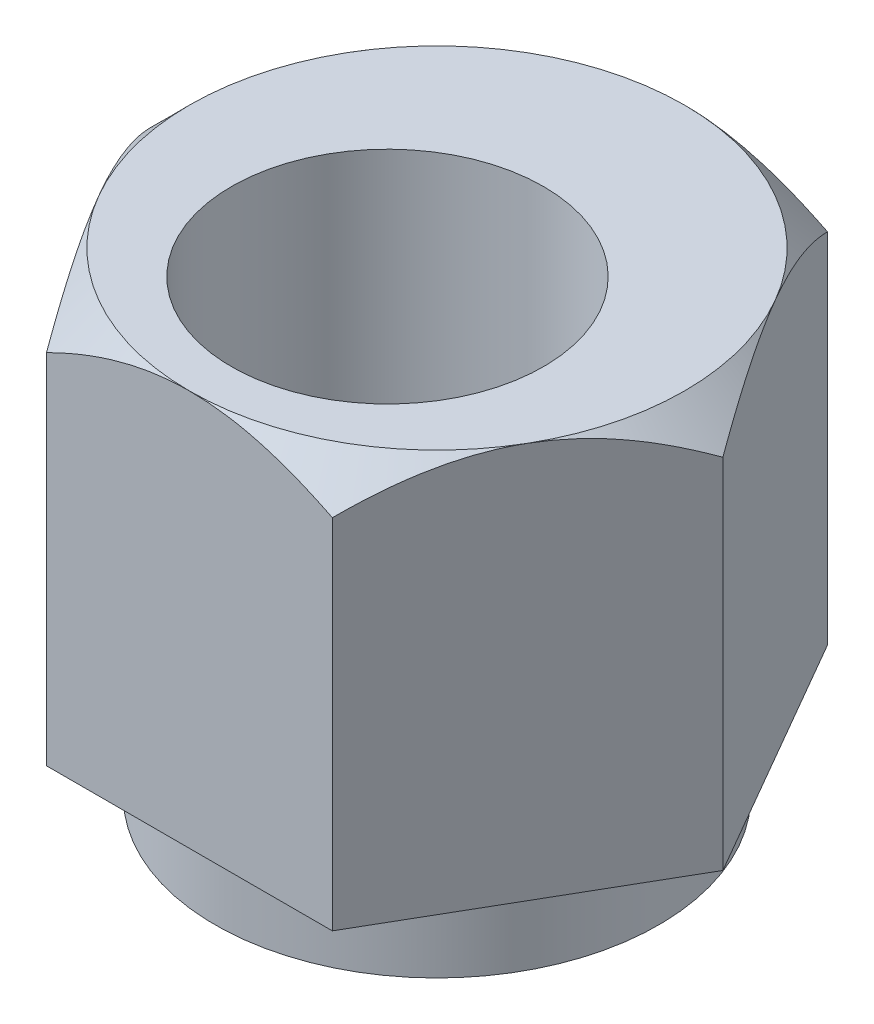
ISO-10303-21;
HEADER;
FILE_DESCRIPTION(('STEP AP214'),'2;1');
FILE_NAME('part.step','',(''),(''),'','','');
FILE_SCHEMA(('AUTOMOTIVE_DESIGN { 1 0 10303 214 1 1 1 1 }'));
ENDSEC;
DATA;
#1=APPLICATION_CONTEXT('core data for automotive mechanical design processes');
#2=APPLICATION_PROTOCOL_DEFINITION('international standard','automotive_design',2000,#1);
#3=PRODUCT_CONTEXT('',#1,'mechanical');
#4=PRODUCT('Part','Part','',(#3));
#5=PRODUCT_RELATED_PRODUCT_CATEGORY('part','',(#4));
#6=PRODUCT_DEFINITION_FORMATION('','',#4);
#7=PRODUCT_DEFINITION_CONTEXT('part definition',#1,'design');
#8=PRODUCT_DEFINITION('design','',#6,#7);
#9=PRODUCT_DEFINITION_SHAPE('','',#8);
#10=(LENGTH_UNIT() NAMED_UNIT(*) SI_UNIT(.MILLI.,.METRE.));
#11=(NAMED_UNIT(*) PLANE_ANGLE_UNIT() SI_UNIT($,.RADIAN.));
#12=(NAMED_UNIT(*) SI_UNIT($,.STERADIAN.) SOLID_ANGLE_UNIT());
#13=UNCERTAINTY_MEASURE_WITH_UNIT(LENGTH_MEASURE(1.E-05),#10,'distance_accuracy_value','');
#14=(GEOMETRIC_REPRESENTATION_CONTEXT(3) GLOBAL_UNCERTAINTY_ASSIGNED_CONTEXT((#13)) GLOBAL_UNIT_ASSIGNED_CONTEXT((#10,
#11,#12)) REPRESENTATION_CONTEXT('',''));
#15=CARTESIAN_POINT('',(0.,0.,0.));
#16=DIRECTION('',(0.,0.,1.));
#17=DIRECTION('',(1.,0.,0.));
#18=AXIS2_PLACEMENT_3D('',#15,#16,#17);
#19=CARTESIAN_POINT('',(-2.2913588808461,0.,3.96875));
#20=DIRECTION('',(0.,0.,1.));
#21=DIRECTION('',(1.,0.,0.));
#22=AXIS2_PLACEMENT_3D('',#19,#20,#21);
#23=PLANE('',#22);
#24=CARTESIAN_POINT('',(0.,6.35000000001037,3.96875));
#25=CARTESIAN_POINT('',(0.0609557316730459,6.35000488133722,3.96875));
#26=CARTESIAN_POINT('',(0.121902350553326,6.34859497366169,3.96875));
#27=CARTESIAN_POINT('',(0.243658193729356,6.34299156350032,3.96875));
#28=CARTESIAN_POINT('',(0.304467438128406,6.33879849888888,3.96875));
#29=CARTESIAN_POINT('',(0.486299334097612,6.32213482831598,3.96875));
#30=CARTESIAN_POINT('',(0.606967881394216,6.30557938195311,3.96875));
#31=CARTESIAN_POINT('',(0.844645959809906,6.26277651278756,3.96875));
#32=CARTESIAN_POINT('',(0.961683228128024,6.23667902816225,3.96875));
#33=CARTESIAN_POINT('',(1.19353706573176,6.17592700561008,3.96875));
#34=CARTESIAN_POINT('',(1.30835292735248,6.14126978771224,3.96875));
#35=CARTESIAN_POINT('',(1.49612748570887,6.07793770471814,3.96875));
#36=CARTESIAN_POINT('',(1.56980436757749,6.05135110793283,3.96875));
#37=CARTESIAN_POINT('',(1.71607903531892,5.99540177755504,3.96875));
#38=CARTESIAN_POINT('',(1.78867704507206,5.96603962950481,3.96875));
#39=CARTESIAN_POINT('',(1.93356616677268,5.90453387116771,3.96875));
#40=CARTESIAN_POINT('',(2.0058463431296,5.87236463934303,3.96875));
#41=CARTESIAN_POINT('',(2.14936914087365,5.80579822195621,3.96875));
#42=CARTESIAN_POINT('',(2.22061183097528,5.77140118477506,3.96875));
#43=CARTESIAN_POINT('',(2.29135881011243,5.73603227368466,3.96875));
#44=B_SPLINE_CURVE_WITH_KNOTS('',3,(#24,#25,#26,#27,#28,#29,#30,#31,#32,#33,#34,#35,#36,#37,#38,
#39,#40,#41,#42,#43),.UNSPECIFIED.,.F.,.F.,(4,2,2,2,2,2,2,2,2,4),(0.,0.182833467204107,
0.365638176014578,0.730525119994046,1.0899089115664,1.44940536573622,1.68433370731859,
1.9192125975474,2.15652018843151,2.39381198987742),.UNSPECIFIED.);
#45=CARTESIAN_POINT('',(0.,6.350000000004,3.96875000000637));
#46=VERTEX_POINT('',#45);
#47=CARTESIAN_POINT('',(2.29135884547952,5.73603225600112,3.96875));
#48=VERTEX_POINT('',#47);
#49=EDGE_CURVE('E212',#46,#48,#44,.T.);
#50=ORIENTED_EDGE('',*,*,#49,.F.);
#51=CARTESIAN_POINT('',(-2.29135889498472,5.73603223124852,3.96875));
#52=CARTESIAN_POINT('',(-2.21206069060932,5.77567522469929,3.96875));
#53=CARTESIAN_POINT('',(-2.13214930134165,5.81409385590243,3.96875));
#54=CARTESIAN_POINT('',(-1.97097660547513,5.8881082508261,3.96875));
#55=CARTESIAN_POINT('',(-1.88971454871652,5.92370237783419,3.96875));
#56=CARTESIAN_POINT('',(-1.64288471432053,6.0260215787352,3.96875));
#57=CARTESIAN_POINT('',(-1.47521050985534,6.08780433701921,3.96875));
#58=CARTESIAN_POINT('',(-1.13930275837644,6.19268916957268,3.96875));
#59=CARTESIAN_POINT('',(-0.971227096592204,6.23628197775752,3.96875));
#60=CARTESIAN_POINT('',(-0.716427954487995,6.28671462111019,3.96875));
#61=CARTESIAN_POINT('',(-0.631153669824669,6.30102430589624,3.96875));
#62=CARTESIAN_POINT('',(-0.459891862641758,6.32434198360343,3.96875));
#63=CARTESIAN_POINT('',(-0.373904568105045,6.33335160958217,3.96875));
#64=CARTESIAN_POINT('',(-0.239948022420144,6.3430391311263,3.96875));
#65=CARTESIAN_POINT('',(-0.192110633518143,6.34564069330178,3.96875));
#66=CARTESIAN_POINT('',(-0.0961836590352683,6.34912553367231,3.96875));
#67=CARTESIAN_POINT('',(-0.0480938250504291,6.35000196490856,3.96875));
#68=CARTESIAN_POINT('',(0.,6.35000000001037,3.96875));
#69=B_SPLINE_CURVE_WITH_KNOTS('',3,(#51,#52,#53,#54,#55,#56,#57,#58,#59,#60,#61,#62,#63,#64,#65,
#66,#67,#68),.UNSPECIFIED.,.F.,.F.,(4,2,2,2,2,2,2,2,4),(0.,0.265949929233719,0.5320528595878,
1.06740851487462,1.58720504023264,1.84646725333807,2.10564954050202,2.24934610610617,
2.39361185535044),.UNSPECIFIED.);
#70=CARTESIAN_POINT('',(-2.2913588985323,5.73603225600605,3.96874996936426));
#71=VERTEX_POINT('',#70);
#72=EDGE_CURVE('E226',#71,#46,#69,.T.);
#73=ORIENTED_EDGE('',*,*,#72,.F.);
#74=DIRECTION('',(0.,1.,0.));
#75=VECTOR('',#74,1.);
#76=CARTESIAN_POINT('',(-2.29135888084509,0.,3.96874999999942));
#77=LINE('',#76,#75);
#78=CARTESIAN_POINT('',(-2.29135888084509,0.,3.96874999999942));
#79=VERTEX_POINT('',#78);
#80=EDGE_CURVE('E111',#79,#71,#77,.T.);
#81=ORIENTED_EDGE('',*,*,#80,.F.);
#82=DIRECTION('',(1.,0.,0.));
#83=VECTOR('',#82,1.);
#84=CARTESIAN_POINT('',(0.,0.,3.96875));
#85=LINE('',#84,#83);
#86=CARTESIAN_POINT('',(2.29135888084661,0.,3.96875));
#87=VERTEX_POINT('',#86);
#88=EDGE_CURVE('E263',#79,#87,#85,.T.);
#89=ORIENTED_EDGE('',*,*,#88,.T.);
#90=DIRECTION('',(0.,1.,0.));
#91=VECTOR('',#90,1.);
#92=CARTESIAN_POINT('',(2.29135888084661,0.,3.96875));
#93=LINE('',#92,#91);
#94=EDGE_CURVE('E298',#48,#87,#93,.F.);
#95=ORIENTED_EDGE('',*,*,#94,.F.);
#96=EDGE_LOOP('',(#50,#73,#81,#89,#95));
#97=FACE_BOUND('',#96,.T.);
#98=ADVANCED_FACE('F17',(#97),#23,.T.);
#99=CARTESIAN_POINT('',(2.29135888084661,0.,3.96875));
#100=DIRECTION('',(0.866025403784429,0.,0.500000000000017));
#101=DIRECTION('',(0.500000000000017,0.,-0.866025403784429));
#102=AXIS2_PLACEMENT_3D('',#99,#100,#101);
#103=PLANE('',#102);
#104=CARTESIAN_POINT('',(3.43703832126962,6.35000000001008,1.98437500000035));
#105=CARTESIAN_POINT('',(3.46751618710615,6.35000488133694,1.93158578786522));
#106=CARTESIAN_POINT('',(3.49798949654629,6.34859497366141,1.87880446764013));
#107=CARTESIAN_POINT('',(3.5588674181343,6.34299156350005,1.77336081439049));
#108=CARTESIAN_POINT('',(3.58927204033383,6.3387984988886,1.72069846395598));
#109=CARTESIAN_POINT('',(3.68018798831844,6.32213482831571,1.56322742282836));
#110=CARTESIAN_POINT('',(3.74052226196674,6.30557938195285,1.45872539543173));
#111=CARTESIAN_POINT('',(3.8593613011746,6.26277651278731,1.25289014160107));
#112=CARTESIAN_POINT('',(3.91787993533367,6.23667902816201,1.15153289404803));
#113=CARTESIAN_POINT('',(4.03380685413555,6.17592700560984,0.950741580718274));
#114=CARTESIAN_POINT('',(4.09121478494592,6.141269787712,0.851308127797319));
#115=CARTESIAN_POINT('',(4.18510206412337,6.0779377047184,0.688690590077569));
#116=CARTESIAN_POINT('',(4.22194050505695,6.05135110793366,0.624884538708988));
#117=CARTESIAN_POINT('',(4.29507783892622,5.99540177755711,0.498206960517288));
#118=CARTESIAN_POINT('',(4.33137684380208,5.96603962950755,0.43533523980812));
#119=CARTESIAN_POINT('',(4.40382140465097,5.90453387117191,0.309857579685826));
#120=CARTESIAN_POINT('',(4.43996149282872,5.872364639348,0.247261110771941));
#121=CARTESIAN_POINT('',(4.51172289169935,5.80579822196281,0.122966721905799));
#122=CARTESIAN_POINT('',(4.54734423674949,5.77140118478251,0.0612687424450293));
#123=CARTESIAN_POINT('',(4.58271772631738,5.73603227369299,6.127243241424E-08));
#124=B_SPLINE_CURVE_WITH_KNOTS('',3,(#104,#105,#106,#107,#108,#109,#110,#111,#112,#113,#114,
#115,#116,#117,#118,#119,#120,#121,#122,#123),.UNSPECIFIED.,.F.,.F.,(4,2,2,2,2,2,2,2,2,4),(0.,
0.182833467204109,0.365638176014583,0.730525119994057,1.08990891156643,1.44940536573628,
1.68433370731394,1.91921259753802,2.15652018841731,2.3938119898584),.UNSPECIFIED.);
#125=CARTESIAN_POINT('',(3.43703832127501,6.35000000000386,1.98437500000346));
#126=VERTEX_POINT('',#125);
#127=CARTESIAN_POINT('',(4.58271774400555,5.73603225600482,3.06362162330874E-08));
#128=VERTEX_POINT('',#127);
#129=EDGE_CURVE('E201',#126,#128,#124,.T.);
#130=ORIENTED_EDGE('',*,*,#129,.F.);
#131=CARTESIAN_POINT('',(2.29135887378482,5.73603223125578,3.96875001223138));
#132=CARTESIAN_POINT('',(2.33100797597229,5.77567522470613,3.90007575276819));
#133=CARTESIAN_POINT('',(2.37096367060589,5.81409385590885,3.83087045961109));
#134=CARTESIAN_POINT('',(2.45155001853869,5.88810825083169,3.69129081059507));
#135=CARTESIAN_POINT('',(2.49218104691775,5.92370237783938,3.62091580507876));
#136=CARTESIAN_POINT('',(2.61559596411501,6.0260215787392,3.40715489808121));
#137=CARTESIAN_POINT('',(2.69943306634709,6.08780433702245,3.26194477745591));
#138=CARTESIAN_POINT('',(2.86738694208551,6.19268916957461,2.97104013134886));
#139=CARTESIAN_POINT('',(2.95142477297712,6.23628197775888,2.82548233848673));
#140=CARTESIAN_POINT('',(3.07882434402842,6.28671462111087,2.60481980856339));
#141=CARTESIAN_POINT('',(3.12146148635982,6.30102430589672,2.53097011175588));
#142=CARTESIAN_POINT('',(3.20709238995073,6.32434198360358,2.38265303603839));
#143=CARTESIAN_POINT('',(3.25008603721881,6.33335160958219,2.30818585456738));
#144=CARTESIAN_POINT('',(3.31706431006075,6.34303913112614,2.19217608300194));
#145=CARTESIAN_POINT('',(3.34098300451151,6.34564069330158,2.15074768896251));
#146=CARTESIAN_POINT('',(3.38894649175247,6.34912553367204,2.06767249215299));
#147=CARTESIAN_POINT('',(3.41299140874465,6.35000196490828,2.02602547425876));
#148=CARTESIAN_POINT('',(3.43703832126962,6.35000000001008,1.98437500000035));
#149=B_SPLINE_CURVE_WITH_KNOTS('',3,(#131,#132,#133,#134,#135,#136,#137,#138,#139,#140,#141,
#142,#143,#144,#145,#146,#147,#148),.UNSPECIFIED.,.F.,.F.,(4,2,2,2,2,2,2,2,4),(0.,
0.26594992923192,0.5320528595842,1.06740851486734,1.58720504022195,1.84646725332569,
2.10564954048794,2.24934610609066,2.39361185533347),.UNSPECIFIED.);
#150=EDGE_CURVE('E206',#48,#126,#149,.T.);
#151=ORIENTED_EDGE('',*,*,#150,.F.);
#152=ORIENTED_EDGE('',*,*,#94,.T.);
#153=DIRECTION('',(0.500000000000129,0.,-0.866025403784364));
#154=VECTOR('',#153,1.);
#155=CARTESIAN_POINT('',(2.29135888084661,0.,3.96875));
#156=LINE('',#155,#154);
#157=CARTESIAN_POINT('',(4.58271776169366,0.,-1.11205211601781E-13));
#158=VERTEX_POINT('',#157);
#159=EDGE_CURVE('E257',#87,#158,#156,.T.);
#160=ORIENTED_EDGE('',*,*,#159,.T.);
#161=DIRECTION('',(0.,1.,0.));
#162=VECTOR('',#161,1.);
#163=CARTESIAN_POINT('',(4.58271776169372,0.,0.));
#164=LINE('',#163,#162);
#165=EDGE_CURVE('E305',#128,#158,#164,.F.);
#166=ORIENTED_EDGE('',*,*,#165,.F.);
#167=EDGE_LOOP('',(#130,#151,#152,#160,#166));
#168=FACE_BOUND('',#167,.T.);
#169=ADVANCED_FACE('F194',(#168),#103,.T.);
#170=CARTESIAN_POINT('',(4.58271776169372,0.,0.));
#171=DIRECTION('',(0.866025403784429,0.,-0.500000000000017));
#172=DIRECTION('',(-0.500000000000017,0.,-0.866025403784429));
#173=AXIS2_PLACEMENT_3D('',#170,#171,#172);
#174=PLANE('',#173);
#175=CARTESIAN_POINT('',(3.43703832127013,6.35000000000949,-1.98437500000064));
#176=CARTESIAN_POINT('',(3.4065604554336,6.35000488133634,-2.03716421213578));
#177=CARTESIAN_POINT('',(3.37608714599345,6.34859497366081,-2.08994553236088));
#178=CARTESIAN_POINT('',(3.31520922440542,6.34299156349943,-2.19538918561054));
#179=CARTESIAN_POINT('',(3.28480460220589,6.33879849888798,-2.24805153604507));
#180=CARTESIAN_POINT('',(3.19388865422126,6.32213482831507,-2.40552257717273));
#181=CARTESIAN_POINT('',(3.13355438057294,6.3055793819522,-2.51002460456938));
#182=CARTESIAN_POINT('',(3.01471534136506,6.26277651278662,-2.71585985840008));
#183=CARTESIAN_POINT('',(2.95619670720599,6.23667902816131,-2.81721710595313));
#184=CARTESIAN_POINT('',(2.84026978840409,6.17592700560911,-3.01800841928292));
#185=CARTESIAN_POINT('',(2.78286185759371,6.14126978771126,-3.11744187220389));
#186=CARTESIAN_POINT('',(2.68897457841555,6.07793770471717,-3.28005940992486));
#187=CARTESIAN_POINT('',(2.65213613748129,6.0513511079319,-3.34386546129462));
#188=CARTESIAN_POINT('',(2.57899880361068,5.99540177755419,-3.47054303948865));
#189=CARTESIAN_POINT('',(2.54269979873416,5.96603962950401,-3.53341476019896));
#190=CARTESIAN_POINT('',(2.47025523788395,5.90453387116701,-3.65889242032354));
#191=CARTESIAN_POINT('',(2.43411514970553,5.87236463934238,-3.72148888923857));
#192=CARTESIAN_POINT('',(2.36235375083361,5.80579822195568,-3.84578327810696));
#193=CARTESIAN_POINT('',(2.32673240578284,5.77140118477459,-3.90748125756883));
#194=CARTESIAN_POINT('',(2.29135891621431,5.73603227368425,-3.96874993874252));
#195=B_SPLINE_CURVE_WITH_KNOTS('',3,(#175,#176,#177,#178,#179,#180,#181,#182,#183,#184,#185,
#186,#187,#188,#189,#190,#191,#192,#193,#194),.UNSPECIFIED.,.F.,.F.,(4,2,2,2,2,2,2,2,2,4),(0.,
0.182833467204152,0.365638176014669,0.730525119994227,1.08990891156667,1.44940536573658,
1.68433370731863,1.9192125975471,2.15652018843087,2.39381198987644),.UNSPECIFIED.);
#196=CARTESIAN_POINT('',(3.43703832127527,6.35000000000356,-1.98437500000361));
#197=VERTEX_POINT('',#196);
#198=CARTESIAN_POINT('',(2.29135889853046,5.73603225600091,-3.96874996937126));
#199=VERTEX_POINT('',#198);
#200=EDGE_CURVE('E180',#197,#199,#195,.T.);
#201=ORIENTED_EDGE('',*,*,#200,.F.);
#202=CARTESIAN_POINT('',(4.58271776876379,5.73603223124658,1.22457202309438E-08));
#203=CARTESIAN_POINT('',(4.54306866657605,5.77567522469741,-0.0686742472179259));
#204=CARTESIAN_POINT('',(4.50311297194218,5.81409385590061,-0.137879540375501));
#205=CARTESIAN_POINT('',(4.42252662400884,5.8881082508244,-0.277459189392463));
#206=CARTESIAN_POINT('',(4.3818955956295,5.92370237783255,-0.347834194909257));
#207=CARTESIAN_POINT('',(4.25848067843138,6.02602157873372,-0.561595101908293));
#208=CARTESIAN_POINT('',(4.1746435761987,6.08780433701784,-0.706805222534634));
#209=CARTESIAN_POINT('',(4.00668970045908,6.1926891695715,-0.997709868643757));
#210=CARTESIAN_POINT('',(3.92265186956687,6.23628197775641,-1.14326766150693));
#211=CARTESIAN_POINT('',(3.79525229851464,6.28671462110918,-1.36393019143187));
#212=CARTESIAN_POINT('',(3.75261515618293,6.30102430589525,-1.43777988823993));
#213=CARTESIAN_POINT('',(3.66698425259139,6.32434198360249,-1.58609696395851));
#214=CARTESIAN_POINT('',(3.62399060532298,6.33335160958125,-1.66056414543007));
#215=CARTESIAN_POINT('',(3.55701233248044,6.3430391311254,-1.77657391699656));
#216=CARTESIAN_POINT('',(3.53309363802939,6.34564069330089,-1.81800231103649));
#217=CARTESIAN_POINT('',(3.48513015078786,6.34912553367143,-1.901077507847));
#218=CARTESIAN_POINT('',(3.4610852337954,6.35000196490769,-1.94272452574173));
#219=CARTESIAN_POINT('',(3.43703832127013,6.35000000000949,-1.98437500000064));
#220=B_SPLINE_CURVE_WITH_KNOTS('',3,(#202,#203,#204,#205,#206,#207,#208,#209,#210,#211,#212,
#213,#214,#215,#216,#217,#218,#219),.UNSPECIFIED.,.F.,.F.,(4,2,2,2,2,2,2,2,4),(0.,
0.265949929233999,0.532052859588362,1.06740851487575,1.58720504023431,1.84646725334001,
2.10564954050422,2.24934610610865,2.39361185535319),.UNSPECIFIED.);
#221=EDGE_CURVE('E186',#128,#197,#220,.T.);
#222=ORIENTED_EDGE('',*,*,#221,.F.);
#223=ORIENTED_EDGE('',*,*,#165,.T.);
#224=DIRECTION('',(-0.500000000000129,0.,-0.866025403784364));
#225=VECTOR('',#224,1.);
#226=CARTESIAN_POINT('',(4.58271776169372,0.,0.));
#227=LINE('',#226,#225);
#228=CARTESIAN_POINT('',(2.29135888084673,0.,-3.96875));
#229=VERTEX_POINT('',#228);
#230=EDGE_CURVE('E244',#158,#229,#227,.T.);
#231=ORIENTED_EDGE('',*,*,#230,.T.);
#232=DIRECTION('',(0.,1.,0.));
#233=VECTOR('',#232,1.);
#234=CARTESIAN_POINT('',(2.29135888084661,0.,-3.96875));
#235=LINE('',#234,#233);
#236=EDGE_CURVE('E314',#199,#229,#235,.F.);
#237=ORIENTED_EDGE('',*,*,#236,.F.);
#238=EDGE_LOOP('',(#201,#222,#223,#231,#237));
#239=FACE_BOUND('',#238,.T.);
#240=ADVANCED_FACE('F191',(#239),#174,.T.);
#241=CARTESIAN_POINT('',(2.29135888084661,0.,-3.96875));
#242=DIRECTION('',(0.,0.,-1.));
#243=DIRECTION('',(-1.,0.,0.));
#244=AXIS2_PLACEMENT_3D('',#241,#242,#243);
#245=PLANE('',#244);
#246=CARTESIAN_POINT('',(0.,6.35000000001037,-3.96875));
#247=CARTESIAN_POINT('',(-0.0609557316730442,6.35000488133722,-3.96875));
#248=CARTESIAN_POINT('',(-0.121902350553323,6.34859497366169,-3.96875));
#249=CARTESIAN_POINT('',(-0.243658193729349,6.34299156350032,-3.96875));
#250=CARTESIAN_POINT('',(-0.304467438128397,6.33879849888888,-3.96875));
#251=CARTESIAN_POINT('',(-0.486299334097599,6.32213482831598,-3.96875));
#252=CARTESIAN_POINT('',(-0.606967881394201,6.30557938195311,-3.96875));
#253=CARTESIAN_POINT('',(-0.844645959809891,6.26277651278756,-3.96875));
#254=CARTESIAN_POINT('',(-0.961683228128012,6.23667902816226,-3.96875));
#255=CARTESIAN_POINT('',(-1.19353706573175,6.17592700561009,-3.96875));
#256=CARTESIAN_POINT('',(-1.30835292735248,6.14126978771225,-3.96875));
#257=CARTESIAN_POINT('',(-1.49612748570752,6.07793770471859,-3.96875));
#258=CARTESIAN_POINT('',(-1.56980436757482,6.05135110793379,-3.96875));
#259=CARTESIAN_POINT('',(-1.71607903531363,5.99540177755712,-3.96875));
#260=CARTESIAN_POINT('',(-1.78867704506548,5.96603962950749,-3.96875));
#261=CARTESIAN_POINT('',(-1.93356616676353,5.9045338711717,-3.96875));
#262=CARTESIAN_POINT('',(-2.00584634311917,5.87236463934772,-3.96875));
#263=CARTESIAN_POINT('',(-2.1493691408607,5.80579822196237,-3.96875));
#264=CARTESIAN_POINT('',(-2.22061183096109,5.77140118478198,-3.96875));
#265=CARTESIAN_POINT('',(-2.291358810097,5.73603227369237,-3.96875));
#266=B_SPLINE_CURVE_WITH_KNOTS('',3,(#246,#247,#248,#249,#250,#251,#252,#253,#254,#255,#256,
#257,#258,#259,#260,#261,#262,#263,#264,#265),.UNSPECIFIED.,.F.,.F.,(4,2,2,2,2,2,2,2,2,4),(0.,
0.182833467204102,0.365638176014568,0.730525119994027,1.08990891156639,1.44940536573622,
1.68433370731433,1.91921259753887,2.15652018841863,2.39381198986018),.UNSPECIFIED.);
#267=CARTESIAN_POINT('',(0.,6.350000000004,-3.96875000000637));
#268=VERTEX_POINT('',#267);
#269=CARTESIAN_POINT('',(-2.29135884547155,5.7360322560051,-3.96875));
#270=VERTEX_POINT('',#269);
#271=EDGE_CURVE('E156',#268,#270,#266,.T.);
#272=ORIENTED_EDGE('',*,*,#271,.F.);
#273=CARTESIAN_POINT('',(2.29135889497027,5.73603223125574,-3.96875));
#274=CARTESIAN_POINT('',(2.21206069059531,5.77567522470611,-3.96875));
#275=CARTESIAN_POINT('',(2.13214930132809,5.81409385590884,-3.96875));
#276=CARTESIAN_POINT('',(1.97097660546247,5.88810825083172,-3.96875));
#277=CARTESIAN_POINT('',(1.88971454870432,5.92370237783943,-3.96875));
#278=CARTESIAN_POINT('',(1.64288471430976,6.0260215787393,-3.96875));
#279=CARTESIAN_POINT('',(1.47521050984557,6.08780433702259,-3.96875));
#280=CARTESIAN_POINT('',(1.13930275836865,6.1926891695748,-3.96875));
#281=CARTESIAN_POINT('',(0.971227096585415,6.23628197775909,-3.96875));
#282=CARTESIAN_POINT('',(0.716427954482746,6.28671462111111,-3.96875));
#283=CARTESIAN_POINT('',(0.631153669819939,6.30102430589697,-3.96875));
#284=CARTESIAN_POINT('',(0.459891862638079,6.32434198360384,-3.96875));
#285=CARTESIAN_POINT('',(0.373904568101899,6.33335160958246,-3.96875));
#286=CARTESIAN_POINT('',(0.239948022417965,6.34303913112643,-3.96875));
#287=CARTESIAN_POINT('',(0.192110633516397,6.34564069330186,-3.96875));
#288=CARTESIAN_POINT('',(0.0961836590343922,6.34912553367233,-3.96875));
#289=CARTESIAN_POINT('',(0.0480938250499909,6.35000196490856,-3.96875));
#290=CARTESIAN_POINT('',(0.,6.35000000001037,-3.96875));
#291=B_SPLINE_CURVE_WITH_KNOTS('',3,(#273,#274,#275,#276,#277,#278,#279,#280,#281,#282,#283,
#284,#285,#286,#287,#288,#289,#290),.UNSPECIFIED.,.F.,.F.,(4,2,2,2,2,2,2,2,4),(0.,
0.26594992923199,0.53205285958434,1.06740851486762,1.58720504022236,1.84646725332616,
2.10564954048848,2.24934610609134,2.39361185533429),.UNSPECIFIED.);
#292=EDGE_CURVE('E175',#199,#268,#291,.T.);
#293=ORIENTED_EDGE('',*,*,#292,.F.);
#294=ORIENTED_EDGE('',*,*,#236,.T.);
#295=DIRECTION('',(1.,0.,0.));
#296=VECTOR('',#295,1.);
#297=CARTESIAN_POINT('',(0.,0.,-3.96875));
#298=LINE('',#297,#296);
#299=CARTESIAN_POINT('',(-2.2913588808461,0.,-3.96875));
#300=VERTEX_POINT('',#299);
#301=EDGE_CURVE('E239',#229,#300,#298,.F.);
#302=ORIENTED_EDGE('',*,*,#301,.T.);
#303=DIRECTION('',(0.,1.,0.));
#304=VECTOR('',#303,1.);
#305=CARTESIAN_POINT('',(-2.2913588808461,0.,-3.96875));
#306=LINE('',#305,#304);
#307=EDGE_CURVE('E112',#270,#300,#306,.F.);
#308=ORIENTED_EDGE('',*,*,#307,.F.);
#309=EDGE_LOOP('',(#272,#293,#294,#302,#308));
#310=FACE_BOUND('',#309,.T.);
#311=ADVANCED_FACE('F147',(#310),#245,.T.);
#312=CARTESIAN_POINT('',(-2.2913588808461,0.,-3.96875));
#313=DIRECTION('',(-0.866025403784429,0.,-0.500000000000017));
#314=DIRECTION('',(-0.500000000000017,0.,0.866025403784429));
#315=AXIS2_PLACEMENT_3D('',#312,#313,#314);
#316=PLANE('',#315);
#317=CARTESIAN_POINT('',(-3.43703832126924,6.35000000001052,-1.98437500000013));
#318=CARTESIAN_POINT('',(-3.46751618710576,6.35000488133738,-1.93158578786501));
#319=CARTESIAN_POINT('',(-3.4979894965459,6.34859497366185,-1.87880446763992));
#320=CARTESIAN_POINT('',(-3.55886741813391,6.34299156350049,-1.7733608143903));
#321=CARTESIAN_POINT('',(-3.58927204033343,6.33879849888905,-1.72069846395579));
#322=CARTESIAN_POINT('',(-3.68018798831803,6.32213482831616,-1.56322742282818));
#323=CARTESIAN_POINT('',(-3.74052226196633,6.30557938195329,-1.45872539543157));
#324=CARTESIAN_POINT('',(-3.85936130117417,6.26277651278776,-1.25289014160093));
#325=CARTESIAN_POINT('',(-3.91787993533323,6.23667902816246,-1.1515328940479));
#326=CARTESIAN_POINT('',(-4.0338068541351,6.1759270056103,-0.950741580718169));
#327=CARTESIAN_POINT('',(-4.09121478494546,6.14126978771247,-0.851308127797225));
#328=CARTESIAN_POINT('',(-4.18510206412301,6.07793770471881,-0.688690590077322));
#329=CARTESIAN_POINT('',(-4.22194050505668,6.051351107934,-0.624884538708579));
#330=CARTESIAN_POINT('',(-4.29507783892613,5.99540177755729,-0.498206960516562));
#331=CARTESIAN_POINT('',(-4.33137684380208,5.96603962950764,-0.435335239807237));
#332=CARTESIAN_POINT('',(-4.40382140465115,5.90453387117181,-0.309857579684631));
#333=CARTESIAN_POINT('',(-4.439961492829,5.8723646393478,-0.24726111077059));
#334=CARTESIAN_POINT('',(-4.5117228916998,5.80579822196241,-0.122966721904142));
#335=CARTESIAN_POINT('',(-4.54734423675002,5.771401184782,-0.0612687424432213));
#336=CARTESIAN_POINT('',(-4.582717726318,5.73603227369237,-6.12704754211628E-08));
#337=B_SPLINE_CURVE_WITH_KNOTS('',3,(#317,#318,#319,#320,#321,#322,#323,#324,#325,#326,#327,
#328,#329,#330,#331,#332,#333,#334,#335,#336),.UNSPECIFIED.,.F.,.F.,(4,2,2,2,2,2,2,2,2,4),(0.,
0.182833467204089,0.365638176014544,0.730525119993978,1.08990891156631,1.44940536573612,
1.68433370731437,1.91921259753906,2.15652018841896,2.39381198986066),.UNSPECIFIED.);
#338=CARTESIAN_POINT('',(-3.43703832127482,6.35000000000408,-1.98437500000335));
#339=VERTEX_POINT('',#338);
#340=CARTESIAN_POINT('',(-4.58271774400459,5.73603225600578,-3.06352380355938E-08));
#341=VERTEX_POINT('',#340);
#342=EDGE_CURVE('E91',#339,#341,#337,.T.);
#343=ORIENTED_EDGE('',*,*,#342,.F.);
#344=CARTESIAN_POINT('',(-2.29135887377671,5.73603223124844,-3.96875001224454));
#345=CARTESIAN_POINT('',(-2.33100797596441,5.77567522469923,-3.90007575278095));
#346=CARTESIAN_POINT('',(-2.37096367059826,5.81409385590238,-3.83087045962343));
#347=CARTESIAN_POINT('',(-2.45155001853153,5.88810825082607,-3.69129081060657));
#348=CARTESIAN_POINT('',(-2.49218104691085,5.92370237783418,-3.62091580508984));
#349=CARTESIAN_POINT('',(-2.61559596410887,6.02602157873522,-3.40715489809097));
#350=CARTESIAN_POINT('',(-2.69943306634148,6.08780433701926,-3.26194477746475));
#351=CARTESIAN_POINT('',(-2.86738694208096,6.19268916957277,-2.97104013135586));
#352=CARTESIAN_POINT('',(-2.9514247729731,6.23628197775762,-2.82548233849281));
#353=CARTESIAN_POINT('',(-3.07882434402523,6.28671462111031,-2.60481980856804));
#354=CARTESIAN_POINT('',(-3.1214614863569,6.30102430589637,-2.53097011176005));
#355=CARTESIAN_POINT('',(-3.20709238994838,6.32434198360357,-2.38265303604159));
#356=CARTESIAN_POINT('',(-3.25008603721674,6.33335160958232,-2.30818585457009));
#357=CARTESIAN_POINT('',(-3.3170643100592,6.34303913112645,-2.19217608300375));
#358=CARTESIAN_POINT('',(-3.34098300451019,6.34564069330193,-2.15074768896391));
#359=CARTESIAN_POINT('',(-3.38894649175162,6.34912553367246,-2.06767249215359));
#360=CARTESIAN_POINT('',(-3.41299140874403,6.35000196490872,-2.02602547425895));
#361=CARTESIAN_POINT('',(-3.43703832126924,6.35000000001052,-1.98437500000013));
#362=B_SPLINE_CURVE_WITH_KNOTS('',3,(#344,#345,#346,#347,#348,#349,#350,#351,#352,#353,#354,
#355,#356,#357,#358,#359,#360,#361),.UNSPECIFIED.,.F.,.F.,(4,2,2,2,2,2,2,2,4),(0.,
0.265949929233769,0.532052859587901,1.06740851487483,1.58720504023294,1.84646725333842,
2.10564954050242,2.24934610610653,2.39361185535076),.UNSPECIFIED.);
#363=EDGE_CURVE('E46',#270,#339,#362,.T.);
#364=ORIENTED_EDGE('',*,*,#363,.F.);
#365=ORIENTED_EDGE('',*,*,#307,.T.);
#366=DIRECTION('',(-0.499999999999796,0.,0.866025403784556));
#367=VECTOR('',#366,1.);
#368=CARTESIAN_POINT('',(-2.2913588808461,0.,-3.96875));
#369=LINE('',#368,#367);
#370=CARTESIAN_POINT('',(-4.58271776169124,0.,-1.09523534345022E-13));
#371=VERTEX_POINT('',#370);
#372=EDGE_CURVE('E106',#300,#371,#369,.T.);
#373=ORIENTED_EDGE('',*,*,#372,.T.);
#374=DIRECTION('',(0.,1.,0.));
#375=VECTOR('',#374,1.);
#376=CARTESIAN_POINT('',(-4.58271776169118,0.,0.));
#377=LINE('',#376,#375);
#378=EDGE_CURVE('E101',#341,#371,#377,.F.);
#379=ORIENTED_EDGE('',*,*,#378,.F.);
#380=EDGE_LOOP('',(#343,#364,#365,#373,#379));
#381=FACE_BOUND('',#380,.T.);
#382=ADVANCED_FACE('F102',(#381),#316,.T.);
#383=CARTESIAN_POINT('',(-4.58271776169118,0.,0.));
#384=DIRECTION('',(-0.866025403784429,0.,0.500000000000017));
#385=DIRECTION('',(0.500000000000017,0.,0.866025403784429));
#386=AXIS2_PLACEMENT_3D('',#383,#384,#385);
#387=PLANE('',#386);
#388=CARTESIAN_POINT('',(-3.43703832126823,6.35000000001169,1.98437499999954));
#389=CARTESIAN_POINT('',(-3.40656045543171,6.35000488133854,2.03716421213465));
#390=CARTESIAN_POINT('',(-3.37608714599158,6.34859497366301,2.08994553235972));
#391=CARTESIAN_POINT('',(-3.31520922440359,6.34299156350164,2.19538918560933));
#392=CARTESIAN_POINT('',(-3.28480460220407,6.33879849889019,2.24805153604382));
#393=CARTESIAN_POINT('',(-3.19388865421949,6.32213482831729,2.40552257717139));
#394=CARTESIAN_POINT('',(-3.13355438057121,6.30557938195442,2.51002460456798));
#395=CARTESIAN_POINT('',(-3.0147153413634,6.26277651278887,2.71585985839857));
#396=CARTESIAN_POINT('',(-2.95619670720435,6.23667902816357,2.81721710595156));
#397=CARTESIAN_POINT('',(-2.84026978840252,6.17592700561141,3.01800841928125));
#398=CARTESIAN_POINT('',(-2.78286185759217,6.14126978771358,3.11744187220217));
#399=CARTESIAN_POINT('',(-2.68897457841463,6.0779377047199,3.28005940992206));
#400=CARTESIAN_POINT('',(-2.65213613748094,6.05135110793508,3.34386546129083));
#401=CARTESIAN_POINT('',(-2.57899880361147,5.99540177755834,3.47054303948288));
#402=CARTESIAN_POINT('',(-2.54269979873551,5.96603962950868,3.53341476019222));
#403=CARTESIAN_POINT('',(-2.47025523788642,5.90453387117281,3.65889242031487));
#404=CARTESIAN_POINT('',(-2.43411514970856,5.87236463934878,3.72148888922893));
#405=CARTESIAN_POINT('',(-2.36235375083774,5.80579822196335,3.84578327809541));
#406=CARTESIAN_POINT('',(-2.3267324057875,5.77140118478292,3.90748125755635));
#407=CARTESIAN_POINT('',(-2.29135891621952,5.73603227369327,3.96874993872911));
#408=B_SPLINE_CURVE_WITH_KNOTS('',3,(#388,#389,#390,#391,#392,#393,#394,#395,#396,#397,#398,
#399,#400,#401,#402,#403,#404,#405,#406,#407),.UNSPECIFIED.,.F.,.F.,(4,2,2,2,2,2,2,2,2,4),(0.,
0.182833467204047,0.365638176014458,0.730525119993807,1.08990891156606,1.44940536573578,
1.68433370731411,1.91921259753888,2.15652018841886,2.39381198986064),.UNSPECIFIED.);
#409=CARTESIAN_POINT('',(-3.43703832127431,6.35000000000466,1.98437500000306));
#410=VERTEX_POINT('',#409);
#411=EDGE_CURVE('E21',#410,#71,#408,.T.);
#412=ORIENTED_EDGE('',*,*,#411,.F.);
#413=CARTESIAN_POINT('',(-4.58271776876024,5.73603223125013,-1.22439741515702E-08));
#414=CARTESIAN_POINT('',(-4.54306866657256,5.77567522470088,0.0686742472195808));
#415=CARTESIAN_POINT('',(-4.50311297193874,5.814093855904,0.137879540377063));
#416=CARTESIAN_POINT('',(-4.4225266240055,5.88810825082764,0.277459189393839));
#417=CARTESIAN_POINT('',(-4.38189559562622,5.92370237783572,0.347834194910538));
#418=CARTESIAN_POINT('',(-4.25848067842827,6.02602157873668,0.561595101909283));
#419=CARTESIAN_POINT('',(-4.1746435761957,6.08780433702066,0.706805222535423));
#420=CARTESIAN_POINT('',(-4.00668970045631,6.19268916957408,0.997709868644144));
#421=CARTESIAN_POINT('',(-3.92265186956422,6.2362819777589,1.14326766150711));
#422=CARTESIAN_POINT('',(-3.79525229851217,6.28671462111154,1.36393019143175));
#423=CARTESIAN_POINT('',(-3.75261515618052,6.30102430589758,1.4377798882397));
#424=CARTESIAN_POINT('',(-3.6669842525891,6.32434198360477,1.58609696395808));
#425=CARTESIAN_POINT('',(-3.62399060532076,6.3333516095835,1.66056414542953));
#426=CARTESIAN_POINT('',(-3.55701233247832,6.34303913112763,1.77657391699584));
#427=CARTESIAN_POINT('',(-3.53309363802731,6.34564069330311,1.81800231103569));
#428=CARTESIAN_POINT('',(-3.48513015078587,6.34912553367363,1.90107750784605));
#429=CARTESIAN_POINT('',(-3.46108523379345,6.35000196490989,1.9427245257407));
#430=CARTESIAN_POINT('',(-3.43703832126823,6.35000000001169,1.98437499999954));
#431=B_SPLINE_CURVE_WITH_KNOTS('',3,(#413,#414,#415,#416,#417,#418,#419,#420,#421,#422,#423,
#424,#425,#426,#427,#428,#429,#430),.UNSPECIFIED.,.F.,.F.,(4,2,2,2,2,2,2,2,4),(0.,
0.265949929233611,0.532052859587585,1.06740851487419,1.587205040232,1.84646725333732,
2.10564954050116,2.24934610610533,2.39361185534961),.UNSPECIFIED.);
#432=EDGE_CURVE('E88',#341,#410,#431,.T.);
#433=ORIENTED_EDGE('',*,*,#432,.F.);
#434=ORIENTED_EDGE('',*,*,#378,.T.);
#435=DIRECTION('',(0.499999999999796,0.,0.866025403784556));
#436=VECTOR('',#435,1.);
#437=CARTESIAN_POINT('',(-4.58271776169118,0.,0.));
#438=LINE('',#437,#436);
#439=EDGE_CURVE('E342',#371,#79,#438,.T.);
#440=ORIENTED_EDGE('',*,*,#439,.T.);
#441=ORIENTED_EDGE('',*,*,#80,.T.);
#442=EDGE_LOOP('',(#412,#433,#434,#440,#441));
#443=FACE_BOUND('',#442,.T.);
#444=ADVANCED_FACE('F114',(#443),#387,.T.);
#445=CARTESIAN_POINT('',(0.,0.,0.));
#446=DIRECTION('',(0.,1.,0.));
#447=DIRECTION('',(0.,0.,1.));
#448=AXIS2_PLACEMENT_3D('',#445,#446,#447);
#449=PLANE('',#448);
#450=CARTESIAN_POINT('',(0.,0.,0.));
#451=DIRECTION('',(0.,-1.,0.));
#452=DIRECTION('',(0.,0.,-1.));
#453=AXIS2_PLACEMENT_3D('',#450,#451,#452);
#454=CIRCLE('',#453,3.556);
#455=CARTESIAN_POINT('',(0.,0.,-3.556));
#456=VERTEX_POINT('',#455);
#457=EDGE_CURVE('E118',#456,#456,#454,.T.);
#458=ORIENTED_EDGE('',*,*,#457,.F.);
#459=EDGE_LOOP('',(#458));
#460=FACE_BOUND('',#459,.T.);
#461=ORIENTED_EDGE('',*,*,#301,.F.);
#462=ORIENTED_EDGE('',*,*,#230,.F.);
#463=ORIENTED_EDGE('',*,*,#159,.F.);
#464=ORIENTED_EDGE('',*,*,#88,.F.);
#465=ORIENTED_EDGE('',*,*,#439,.F.);
#466=ORIENTED_EDGE('',*,*,#372,.F.);
#467=EDGE_LOOP('',(#461,#462,#463,#464,#465,#466));
#468=FACE_BOUND('',#467,.T.);
#469=ADVANCED_FACE('F142',(#460,#468),#449,.F.);
#470=CARTESIAN_POINT('',(0.,5.7323484318772,0.));
#471=DIRECTION('',(0.,-1.,0.));
#472=DIRECTION('',(0.,0.,-1.));
#473=AXIS2_PLACEMENT_3D('',#470,#471,#472);
#474=CONICAL_SURFACE('',#473,4.58640156813317,0.785398163397448);
#475=ORIENTED_EDGE('',*,*,#72,.T.);
#476=CARTESIAN_POINT('',(0.,6.34999999999764,0.));
#477=DIRECTION('',(0.,-1.,0.));
#478=DIRECTION('',(0.,0.,-1.));
#479=AXIS2_PLACEMENT_3D('',#476,#477,#478);
#480=CIRCLE('',#479,3.96875000001273);
#481=EDGE_CURVE('E124',#410,#46,#480,.F.);
#482=ORIENTED_EDGE('',*,*,#481,.F.);
#483=ORIENTED_EDGE('',*,*,#411,.T.);
#484=EDGE_LOOP('',(#475,#482,#483));
#485=FACE_BOUND('',#484,.T.);
#486=ADVANCED_FACE('F219',(#485),#474,.T.);
#487=CARTESIAN_POINT('',(0.,5.7323484318772,0.));
#488=DIRECTION('',(0.,-1.,0.));
#489=DIRECTION('',(0.,0.,-1.));
#490=AXIS2_PLACEMENT_3D('',#487,#488,#489);
#491=CONICAL_SURFACE('',#490,4.58640156813317,0.785398163397448);
#492=ORIENTED_EDGE('',*,*,#49,.T.);
#493=ORIENTED_EDGE('',*,*,#150,.T.);
#494=CARTESIAN_POINT('',(0.,6.34999999999764,0.));
#495=DIRECTION('',(0.,-1.,0.));
#496=DIRECTION('',(0.,0.,-1.));
#497=AXIS2_PLACEMENT_3D('',#494,#495,#496);
#498=CIRCLE('',#497,3.96875000001273);
#499=EDGE_CURVE('E285',#46,#126,#498,.F.);
#500=ORIENTED_EDGE('',*,*,#499,.F.);
#501=EDGE_LOOP('',(#492,#493,#500));
#502=FACE_BOUND('',#501,.T.);
#503=ADVANCED_FACE('F216',(#502),#491,.T.);
#504=CARTESIAN_POINT('',(0.,5.7323484318772,0.));
#505=DIRECTION('',(0.,-1.,0.));
#506=DIRECTION('',(0.,0.,-1.));
#507=AXIS2_PLACEMENT_3D('',#504,#505,#506);
#508=CONICAL_SURFACE('',#507,4.58640156813317,0.785398163397448);
#509=ORIENTED_EDGE('',*,*,#221,.T.);
#510=CARTESIAN_POINT('',(0.,6.34999999999764,0.));
#511=DIRECTION('',(0.,-1.,0.));
#512=DIRECTION('',(0.,0.,-1.));
#513=AXIS2_PLACEMENT_3D('',#510,#511,#512);
#514=CIRCLE('',#513,3.96875000001273);
#515=EDGE_CURVE('E281',#126,#197,#514,.F.);
#516=ORIENTED_EDGE('',*,*,#515,.F.);
#517=ORIENTED_EDGE('',*,*,#129,.T.);
#518=EDGE_LOOP('',(#509,#516,#517));
#519=FACE_BOUND('',#518,.T.);
#520=ADVANCED_FACE('F170',(#519),#508,.T.);
#521=CARTESIAN_POINT('',(0.,5.7323484318772,0.));
#522=DIRECTION('',(0.,-1.,0.));
#523=DIRECTION('',(0.,0.,-1.));
#524=AXIS2_PLACEMENT_3D('',#521,#522,#523);
#525=CONICAL_SURFACE('',#524,4.58640156813317,0.785398163397448);
#526=ORIENTED_EDGE('',*,*,#200,.T.);
#527=ORIENTED_EDGE('',*,*,#292,.T.);
#528=CARTESIAN_POINT('',(0.,6.34999999999764,0.));
#529=DIRECTION('',(0.,-1.,0.));
#530=DIRECTION('',(0.,0.,-1.));
#531=AXIS2_PLACEMENT_3D('',#528,#529,#530);
#532=CIRCLE('',#531,3.96875000001273);
#533=EDGE_CURVE('E277',#197,#268,#532,.F.);
#534=ORIENTED_EDGE('',*,*,#533,.F.);
#535=EDGE_LOOP('',(#526,#527,#534));
#536=FACE_BOUND('',#535,.T.);
#537=ADVANCED_FACE('F165',(#536),#525,.T.);
#538=CARTESIAN_POINT('',(0.,5.7323484318772,0.));
#539=DIRECTION('',(0.,-1.,0.));
#540=DIRECTION('',(0.,0.,-1.));
#541=AXIS2_PLACEMENT_3D('',#538,#539,#540);
#542=CONICAL_SURFACE('',#541,4.58640156813317,0.785398163397448);
#543=ORIENTED_EDGE('',*,*,#271,.T.);
#544=ORIENTED_EDGE('',*,*,#363,.T.);
#545=CARTESIAN_POINT('',(0.,6.34999999999764,0.));
#546=DIRECTION('',(0.,-1.,0.));
#547=DIRECTION('',(0.,0.,-1.));
#548=AXIS2_PLACEMENT_3D('',#545,#546,#547);
#549=CIRCLE('',#548,3.96875000001273);
#550=EDGE_CURVE('E274',#268,#339,#549,.F.);
#551=ORIENTED_EDGE('',*,*,#550,.F.);
#552=EDGE_LOOP('',(#543,#544,#551));
#553=FACE_BOUND('',#552,.T.);
#554=ADVANCED_FACE('F161',(#553),#542,.T.);
#555=CARTESIAN_POINT('',(0.,5.7323484318772,0.));
#556=DIRECTION('',(0.,-1.,0.));
#557=DIRECTION('',(0.,0.,-1.));
#558=AXIS2_PLACEMENT_3D('',#555,#556,#557);
#559=CONICAL_SURFACE('',#558,4.58640156813317,0.785398163397448);
#560=ORIENTED_EDGE('',*,*,#432,.T.);
#561=CARTESIAN_POINT('',(0.,6.34999999999764,0.));
#562=DIRECTION('',(0.,-1.,0.));
#563=DIRECTION('',(0.,0.,-1.));
#564=AXIS2_PLACEMENT_3D('',#561,#562,#563);
#565=CIRCLE('',#564,3.96875000001273);
#566=EDGE_CURVE('E95',#339,#410,#565,.F.);
#567=ORIENTED_EDGE('',*,*,#566,.F.);
#568=ORIENTED_EDGE('',*,*,#342,.T.);
#569=EDGE_LOOP('',(#560,#567,#568));
#570=FACE_BOUND('',#569,.T.);
#571=ADVANCED_FACE('F93',(#570),#559,.T.);
#572=CARTESIAN_POINT('',(0.,0.,0.));
#573=DIRECTION('',(0.,-1.,0.));
#574=DIRECTION('',(0.,0.,-1.));
#575=AXIS2_PLACEMENT_3D('',#572,#573,#574);
#576=CYLINDRICAL_SURFACE('',#575,3.556);
#577=CARTESIAN_POINT('',(0.,-1.27,0.));
#578=DIRECTION('',(0.,-1.,0.));
#579=DIRECTION('',(0.,0.,-1.));
#580=AXIS2_PLACEMENT_3D('',#577,#578,#579);
#581=CIRCLE('',#580,3.556);
#582=CARTESIAN_POINT('',(0.,-1.27,-3.556));
#583=VERTEX_POINT('',#582);
#584=EDGE_CURVE('E268',#583,#583,#581,.T.);
#585=ORIENTED_EDGE('',*,*,#584,.F.);
#586=EDGE_LOOP('',(#585));
#587=FACE_BOUND('',#586,.T.);
#588=ORIENTED_EDGE('',*,*,#457,.T.);
#589=EDGE_LOOP('',(#588));
#590=FACE_BOUND('',#589,.T.);
#591=ADVANCED_FACE('F388',(#587,#590),#576,.T.);
#592=CARTESIAN_POINT('',(0.,6.35,0.));
#593=DIRECTION('',(0.,1.,0.));
#594=DIRECTION('',(0.,0.,1.));
#595=AXIS2_PLACEMENT_3D('',#592,#593,#594);
#596=PLANE('',#595);
#597=CARTESIAN_POINT('',(0.,6.35,0.79375));
#598=DIRECTION('',(0.,-1.,0.));
#599=DIRECTION('',(0.,0.,-1.));
#600=AXIS2_PLACEMENT_3D('',#597,#598,#599);
#601=CIRCLE('',#600,2.5019);
#602=CARTESIAN_POINT('',(0.,6.35,-1.70815));
#603=VERTEX_POINT('',#602);
#604=EDGE_CURVE('E33',#603,#603,#601,.T.);
#605=ORIENTED_EDGE('',*,*,#604,.T.);
#606=EDGE_LOOP('',(#605));
#607=FACE_BOUND('',#606,.T.);
#608=ORIENTED_EDGE('',*,*,#550,.T.);
#609=ORIENTED_EDGE('',*,*,#566,.T.);
#610=ORIENTED_EDGE('',*,*,#481,.T.);
#611=ORIENTED_EDGE('',*,*,#499,.T.);
#612=ORIENTED_EDGE('',*,*,#515,.T.);
#613=ORIENTED_EDGE('',*,*,#533,.T.);
#614=EDGE_LOOP('',(#608,#609,#610,#611,#612,#613));
#615=FACE_BOUND('',#614,.T.);
#616=ADVANCED_FACE('F290',(#607,#615),#596,.T.);
#617=CARTESIAN_POINT('',(0.,-1.27,0.));
#618=DIRECTION('',(0.,-1.,0.));
#619=DIRECTION('',(0.,0.,-1.));
#620=AXIS2_PLACEMENT_3D('',#617,#618,#619);
#621=PLANE('',#620);
#622=CARTESIAN_POINT('',(0.,-1.27,0.79375));
#623=DIRECTION('',(0.,-1.,0.));
#624=DIRECTION('',(0.,0.,-1.));
#625=AXIS2_PLACEMENT_3D('',#622,#623,#624);
#626=CIRCLE('',#625,2.5019);
#627=CARTESIAN_POINT('',(0.,-1.27,-1.70815));
#628=VERTEX_POINT('',#627);
#629=EDGE_CURVE('E11',#628,#628,#626,.F.);
#630=ORIENTED_EDGE('',*,*,#629,.T.);
#631=EDGE_LOOP('',(#630));
#632=FACE_BOUND('',#631,.T.);
#633=ORIENTED_EDGE('',*,*,#584,.T.);
#634=EDGE_LOOP('',(#633));
#635=FACE_BOUND('',#634,.T.);
#636=ADVANCED_FACE('F376',(#632,#635),#621,.T.);
#637=CARTESIAN_POINT('',(0.,6.35,0.79375));
#638=DIRECTION('',(0.,-1.,0.));
#639=DIRECTION('',(0.,0.,-1.));
#640=AXIS2_PLACEMENT_3D('',#637,#638,#639);
#641=CYLINDRICAL_SURFACE('',#640,2.5019);
#642=ORIENTED_EDGE('',*,*,#629,.F.);
#643=EDGE_LOOP('',(#642));
#644=FACE_BOUND('',#643,.T.);
#645=ORIENTED_EDGE('',*,*,#604,.F.);
#646=EDGE_LOOP('',(#645));
#647=FACE_BOUND('',#646,.T.);
#648=ADVANCED_FACE('F374',(#644,#647),#641,.F.);
#649=CLOSED_SHELL('',(#98,#169,#240,#311,#382,#444,#469,#486,#503,#520,#537,#554,#571,#591,#616,
#636,#648));
#650=MANIFOLD_SOLID_BREP('B1',#649);
#651=ADVANCED_BREP_SHAPE_REPRESENTATION('',(#18,#650),#14);
#652=SHAPE_DEFINITION_REPRESENTATION(#9,#651);
ENDSEC;
END-ISO-10303-21;
